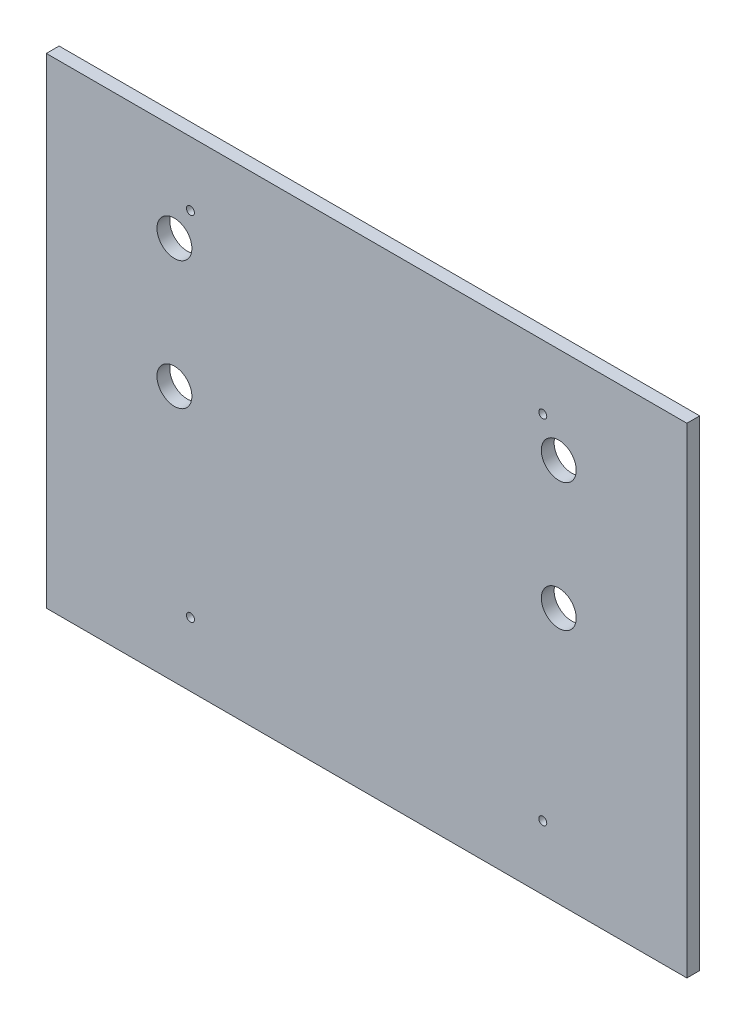
ISO-10303-21;
HEADER;
FILE_DESCRIPTION(('STEP AP214'),'2;1');
FILE_NAME('part.step','',(''),(''),'','','');
FILE_SCHEMA(('AUTOMOTIVE_DESIGN { 1 0 10303 214 1 1 1 1 }'));
ENDSEC;
DATA;
#1=APPLICATION_CONTEXT('core data for automotive mechanical design processes');
#2=APPLICATION_PROTOCOL_DEFINITION('international standard','automotive_design',2000,#1);
#3=PRODUCT_CONTEXT('',#1,'mechanical');
#4=PRODUCT('Part','Part','',(#3));
#5=PRODUCT_RELATED_PRODUCT_CATEGORY('part','',(#4));
#6=PRODUCT_DEFINITION_FORMATION('','',#4);
#7=PRODUCT_DEFINITION_CONTEXT('part definition',#1,'design');
#8=PRODUCT_DEFINITION('design','',#6,#7);
#9=PRODUCT_DEFINITION_SHAPE('','',#8);
#10=(LENGTH_UNIT() NAMED_UNIT(*) SI_UNIT(.MILLI.,.METRE.));
#11=(NAMED_UNIT(*) PLANE_ANGLE_UNIT() SI_UNIT($,.RADIAN.));
#12=(NAMED_UNIT(*) SI_UNIT($,.STERADIAN.) SOLID_ANGLE_UNIT());
#13=UNCERTAINTY_MEASURE_WITH_UNIT(LENGTH_MEASURE(1.E-05),#10,'distance_accuracy_value','');
#14=(GEOMETRIC_REPRESENTATION_CONTEXT(3) GLOBAL_UNCERTAINTY_ASSIGNED_CONTEXT((#13)) GLOBAL_UNIT_ASSIGNED_CONTEXT((#10,
#11,#12)) REPRESENTATION_CONTEXT('',''));
#15=CARTESIAN_POINT('',(0.,0.,0.));
#16=DIRECTION('',(0.,0.,1.));
#17=DIRECTION('',(1.,0.,0.));
#18=AXIS2_PLACEMENT_3D('',#15,#16,#17);
#19=CARTESIAN_POINT('',(0.,0.,8.));
#20=DIRECTION('',(0.,0.,1.));
#21=DIRECTION('',(1.,0.,0.));
#22=AXIS2_PLACEMENT_3D('',#19,#20,#21);
#23=PLANE('',#22);
#24=CARTESIAN_POINT('',(34.3978692290998,-225.797373506058,8.));
#25=DIRECTION('',(0.,0.,1.));
#26=DIRECTION('',(1.,0.,0.));
#27=AXIS2_PLACEMENT_3D('',#24,#25,#26);
#28=CIRCLE('',#27,2.5);
#29=CARTESIAN_POINT('',(36.8978692290998,-225.797373506058,8.));
#30=VERTEX_POINT('',#29);
#31=EDGE_CURVE('E310',#30,#30,#28,.T.);
#32=ORIENTED_EDGE('',*,*,#31,.F.);
#33=EDGE_LOOP('',(#32));
#34=FACE_BOUND('',#33,.T.);
#35=CARTESIAN_POINT('',(254.3978692291,-5.79737350605809,8.));
#36=DIRECTION('',(0.,0.,1.));
#37=DIRECTION('',(1.,0.,0.));
#38=AXIS2_PLACEMENT_3D('',#35,#36,#37);
#39=CIRCLE('',#38,2.50000000000002);
#40=CARTESIAN_POINT('',(256.8978692291,-5.79737350605809,8.));
#41=VERTEX_POINT('',#40);
#42=EDGE_CURVE('E319',#41,#41,#39,.T.);
#43=ORIENTED_EDGE('',*,*,#42,.F.);
#44=EDGE_LOOP('',(#43));
#45=FACE_BOUND('',#44,.T.);
#46=CARTESIAN_POINT('',(264.3978692291,-25.7973735060581,8.));
#47=DIRECTION('',(0.,0.,1.));
#48=DIRECTION('',(-1.,0.,0.));
#49=AXIS2_PLACEMENT_3D('',#46,#47,#48);
#50=CIRCLE('',#49,10.9);
#51=CARTESIAN_POINT('',(253.4978692291,-25.7973735060581,8.));
#52=VERTEX_POINT('',#51);
#53=EDGE_CURVE('E130',#52,#52,#50,.T.);
#54=ORIENTED_EDGE('',*,*,#53,.F.);
#55=EDGE_LOOP('',(#54));
#56=FACE_BOUND('',#55,.T.);
#57=CARTESIAN_POINT('',(24.3978692290998,-105.797373506058,8.));
#58=DIRECTION('',(0.,0.,1.));
#59=DIRECTION('',(1.,0.,0.));
#60=AXIS2_PLACEMENT_3D('',#57,#58,#59);
#61=CIRCLE('',#60,10.9);
#62=CARTESIAN_POINT('',(35.2978692290998,-105.797373506058,8.));
#63=VERTEX_POINT('',#62);
#64=EDGE_CURVE('E131',#63,#63,#61,.T.);
#65=ORIENTED_EDGE('',*,*,#64,.F.);
#66=EDGE_LOOP('',(#65));
#67=FACE_BOUND('',#66,.T.);
#68=DIRECTION('',(0.,-1.,0.));
#69=VECTOR('',#68,1.);
#70=CARTESIAN_POINT('',(-55.6021307709002,34.2026264939419,8.));
#71=LINE('',#70,#69);
#72=CARTESIAN_POINT('',(-55.6021307709002,34.2026264939419,8.));
#73=VERTEX_POINT('',#72);
#74=CARTESIAN_POINT('',(-55.6021307709002,-265.797373506058,8.));
#75=VERTEX_POINT('',#74);
#76=EDGE_CURVE('E92',#73,#75,#71,.T.);
#77=ORIENTED_EDGE('',*,*,#76,.T.);
#78=DIRECTION('',(1.,0.,0.));
#79=VECTOR('',#78,1.);
#80=CARTESIAN_POINT('',(-55.6021307709002,-265.797373506058,8.));
#81=LINE('',#80,#79);
#82=CARTESIAN_POINT('',(344.3978692291,-265.797373506058,8.));
#83=VERTEX_POINT('',#82);
#84=EDGE_CURVE('E87',#75,#83,#81,.T.);
#85=ORIENTED_EDGE('',*,*,#84,.T.);
#86=DIRECTION('',(0.,1.,0.));
#87=VECTOR('',#86,1.);
#88=CARTESIAN_POINT('',(344.3978692291,-265.797373506058,8.));
#89=LINE('',#88,#87);
#90=CARTESIAN_POINT('',(344.3978692291,34.2026264939419,8.));
#91=VERTEX_POINT('',#90);
#92=EDGE_CURVE('E90',#83,#91,#89,.T.);
#93=ORIENTED_EDGE('',*,*,#92,.T.);
#94=DIRECTION('',(-1.,0.,0.));
#95=VECTOR('',#94,1.);
#96=CARTESIAN_POINT('',(-55.6021307709002,34.2026264939419,8.));
#97=LINE('',#96,#95);
#98=EDGE_CURVE('E57',#91,#73,#97,.T.);
#99=ORIENTED_EDGE('',*,*,#98,.T.);
#100=EDGE_LOOP('',(#77,#85,#93,#99));
#101=FACE_BOUND('',#100,.T.);
#102=CARTESIAN_POINT('',(24.3978692290998,-25.7973735060581,8.));
#103=DIRECTION('',(0.,0.,1.));
#104=DIRECTION('',(1.,0.,0.));
#105=AXIS2_PLACEMENT_3D('',#102,#103,#104);
#106=CIRCLE('',#105,10.9);
#107=CARTESIAN_POINT('',(35.2978692290998,-25.7973735060581,8.));
#108=VERTEX_POINT('',#107);
#109=EDGE_CURVE('E118',#108,#108,#106,.T.);
#110=ORIENTED_EDGE('',*,*,#109,.F.);
#111=EDGE_LOOP('',(#110));
#112=FACE_BOUND('',#111,.T.);
#113=CARTESIAN_POINT('',(264.3978692291,-105.797373506058,8.));
#114=DIRECTION('',(0.,0.,1.));
#115=DIRECTION('',(1.,0.,0.));
#116=AXIS2_PLACEMENT_3D('',#113,#114,#115);
#117=CIRCLE('',#116,10.9);
#118=CARTESIAN_POINT('',(275.2978692291,-105.797373506058,8.));
#119=VERTEX_POINT('',#118);
#120=EDGE_CURVE('E329',#119,#119,#117,.T.);
#121=ORIENTED_EDGE('',*,*,#120,.F.);
#122=EDGE_LOOP('',(#121));
#123=FACE_BOUND('',#122,.T.);
#124=CARTESIAN_POINT('',(34.3978692290998,-5.79737350605809,8.));
#125=DIRECTION('',(0.,0.,1.));
#126=DIRECTION('',(-1.,0.,0.));
#127=AXIS2_PLACEMENT_3D('',#124,#125,#126);
#128=CIRCLE('',#127,2.50000000000002);
#129=CARTESIAN_POINT('',(31.8978692290998,-5.79737350605809,8.));
#130=VERTEX_POINT('',#129);
#131=EDGE_CURVE('E328',#130,#130,#128,.T.);
#132=ORIENTED_EDGE('',*,*,#131,.F.);
#133=EDGE_LOOP('',(#132));
#134=FACE_BOUND('',#133,.T.);
#135=CARTESIAN_POINT('',(254.3978692291,-225.797373506058,8.));
#136=DIRECTION('',(0.,0.,1.));
#137=DIRECTION('',(-1.,0.,0.));
#138=AXIS2_PLACEMENT_3D('',#135,#136,#137);
#139=CIRCLE('',#138,2.49999999999997);
#140=CARTESIAN_POINT('',(251.8978692291,-225.797373506058,8.));
#141=VERTEX_POINT('',#140);
#142=EDGE_CURVE('E300',#141,#141,#139,.T.);
#143=ORIENTED_EDGE('',*,*,#142,.F.);
#144=EDGE_LOOP('',(#143));
#145=FACE_BOUND('',#144,.T.);
#146=ADVANCED_FACE('F40',(#34,#45,#56,#67,#101,#112,#123,#134,#145),#23,.T.);
#147=CARTESIAN_POINT('',(0.,0.,0.));
#148=DIRECTION('',(0.,0.,1.));
#149=DIRECTION('',(1.,0.,0.));
#150=AXIS2_PLACEMENT_3D('',#147,#148,#149);
#151=PLANE('',#150);
#152=DIRECTION('',(0.,-1.,0.));
#153=VECTOR('',#152,1.);
#154=CARTESIAN_POINT('',(-55.6021307709002,34.2026264939419,0.));
#155=LINE('',#154,#153);
#156=CARTESIAN_POINT('',(-55.6021307709002,34.2026264939419,0.));
#157=VERTEX_POINT('',#156);
#158=CARTESIAN_POINT('',(-55.6021307709002,-265.797373506058,0.));
#159=VERTEX_POINT('',#158);
#160=EDGE_CURVE('E136',#157,#159,#155,.T.);
#161=ORIENTED_EDGE('',*,*,#160,.F.);
#162=DIRECTION('',(-1.,0.,0.));
#163=VECTOR('',#162,1.);
#164=CARTESIAN_POINT('',(-55.6021307709002,34.2026264939419,0.));
#165=LINE('',#164,#163);
#166=CARTESIAN_POINT('',(344.3978692291,34.2026264939419,0.));
#167=VERTEX_POINT('',#166);
#168=EDGE_CURVE('E80',#167,#157,#165,.T.);
#169=ORIENTED_EDGE('',*,*,#168,.F.);
#170=DIRECTION('',(0.,1.,0.));
#171=VECTOR('',#170,1.);
#172=CARTESIAN_POINT('',(344.3978692291,-265.797373506058,0.));
#173=LINE('',#172,#171);
#174=CARTESIAN_POINT('',(344.3978692291,-265.797373506058,0.));
#175=VERTEX_POINT('',#174);
#176=EDGE_CURVE('E74',#175,#167,#173,.T.);
#177=ORIENTED_EDGE('',*,*,#176,.F.);
#178=DIRECTION('',(1.,0.,0.));
#179=VECTOR('',#178,1.);
#180=CARTESIAN_POINT('',(-55.6021307709002,-265.797373506058,0.));
#181=LINE('',#180,#179);
#182=EDGE_CURVE('E97',#159,#175,#181,.T.);
#183=ORIENTED_EDGE('',*,*,#182,.F.);
#184=EDGE_LOOP('',(#161,#169,#177,#183));
#185=FACE_BOUND('',#184,.T.);
#186=CARTESIAN_POINT('',(24.3978692290998,-105.797373506058,0.));
#187=DIRECTION('',(0.,0.,1.));
#188=DIRECTION('',(1.,0.,0.));
#189=AXIS2_PLACEMENT_3D('',#186,#187,#188);
#190=CIRCLE('',#189,10.9);
#191=CARTESIAN_POINT('',(35.2978692290998,-105.797373506058,0.));
#192=VERTEX_POINT('',#191);
#193=EDGE_CURVE('E124',#192,#192,#190,.T.);
#194=ORIENTED_EDGE('',*,*,#193,.T.);
#195=EDGE_LOOP('',(#194));
#196=FACE_BOUND('',#195,.T.);
#197=CARTESIAN_POINT('',(24.3978692290998,-25.7973735060581,0.));
#198=DIRECTION('',(0.,0.,1.));
#199=DIRECTION('',(1.,0.,0.));
#200=AXIS2_PLACEMENT_3D('',#197,#198,#199);
#201=CIRCLE('',#200,10.9);
#202=CARTESIAN_POINT('',(35.2978692290998,-25.7973735060581,0.));
#203=VERTEX_POINT('',#202);
#204=EDGE_CURVE('E125',#203,#203,#201,.T.);
#205=ORIENTED_EDGE('',*,*,#204,.T.);
#206=EDGE_LOOP('',(#205));
#207=FACE_BOUND('',#206,.T.);
#208=CARTESIAN_POINT('',(264.3978692291,-25.7973735060581,0.));
#209=DIRECTION('',(0.,0.,1.));
#210=DIRECTION('',(-1.,0.,0.));
#211=AXIS2_PLACEMENT_3D('',#208,#209,#210);
#212=CIRCLE('',#211,10.9);
#213=CARTESIAN_POINT('',(253.4978692291,-25.7973735060581,0.));
#214=VERTEX_POINT('',#213);
#215=EDGE_CURVE('E126',#214,#214,#212,.T.);
#216=ORIENTED_EDGE('',*,*,#215,.T.);
#217=EDGE_LOOP('',(#216));
#218=FACE_BOUND('',#217,.T.);
#219=CARTESIAN_POINT('',(264.3978692291,-105.797373506058,0.));
#220=DIRECTION('',(0.,0.,1.));
#221=DIRECTION('',(1.,0.,0.));
#222=AXIS2_PLACEMENT_3D('',#219,#220,#221);
#223=CIRCLE('',#222,10.9);
#224=CARTESIAN_POINT('',(275.2978692291,-105.797373506058,0.));
#225=VERTEX_POINT('',#224);
#226=EDGE_CURVE('E325',#225,#225,#223,.T.);
#227=ORIENTED_EDGE('',*,*,#226,.T.);
#228=EDGE_LOOP('',(#227));
#229=FACE_BOUND('',#228,.T.);
#230=CARTESIAN_POINT('',(254.3978692291,-5.79737350605809,0.));
#231=DIRECTION('',(0.,0.,1.));
#232=DIRECTION('',(1.,0.,0.));
#233=AXIS2_PLACEMENT_3D('',#230,#231,#232);
#234=CIRCLE('',#233,2.50000000000002);
#235=CARTESIAN_POINT('',(256.8978692291,-5.79737350605809,0.));
#236=VERTEX_POINT('',#235);
#237=EDGE_CURVE('E326',#236,#236,#234,.T.);
#238=ORIENTED_EDGE('',*,*,#237,.T.);
#239=EDGE_LOOP('',(#238));
#240=FACE_BOUND('',#239,.T.);
#241=CARTESIAN_POINT('',(34.3978692290998,-5.79737350605809,0.));
#242=DIRECTION('',(0.,0.,1.));
#243=DIRECTION('',(-1.,0.,0.));
#244=AXIS2_PLACEMENT_3D('',#241,#242,#243);
#245=CIRCLE('',#244,2.50000000000002);
#246=CARTESIAN_POINT('',(31.8978692290998,-5.79737350605809,0.));
#247=VERTEX_POINT('',#246);
#248=EDGE_CURVE('E315',#247,#247,#245,.T.);
#249=ORIENTED_EDGE('',*,*,#248,.T.);
#250=EDGE_LOOP('',(#249));
#251=FACE_BOUND('',#250,.T.);
#252=CARTESIAN_POINT('',(34.3978692290998,-225.797373506058,0.));
#253=DIRECTION('',(0.,0.,1.));
#254=DIRECTION('',(1.,0.,0.));
#255=AXIS2_PLACEMENT_3D('',#252,#253,#254);
#256=CIRCLE('',#255,2.5);
#257=CARTESIAN_POINT('',(36.8978692290998,-225.797373506058,0.));
#258=VERTEX_POINT('',#257);
#259=EDGE_CURVE('E307',#258,#258,#256,.T.);
#260=ORIENTED_EDGE('',*,*,#259,.T.);
#261=EDGE_LOOP('',(#260));
#262=FACE_BOUND('',#261,.T.);
#263=CARTESIAN_POINT('',(254.3978692291,-225.797373506058,0.));
#264=DIRECTION('',(0.,0.,1.));
#265=DIRECTION('',(-1.,0.,0.));
#266=AXIS2_PLACEMENT_3D('',#263,#264,#265);
#267=CIRCLE('',#266,2.49999999999997);
#268=CARTESIAN_POINT('',(251.8978692291,-225.797373506058,0.));
#269=VERTEX_POINT('',#268);
#270=EDGE_CURVE('E303',#269,#269,#267,.T.);
#271=ORIENTED_EDGE('',*,*,#270,.T.);
#272=EDGE_LOOP('',(#271));
#273=FACE_BOUND('',#272,.T.);
#274=ADVANCED_FACE('F150',(#185,#196,#207,#218,#229,#240,#251,#262,#273),#151,.F.);
#275=CARTESIAN_POINT('',(-55.6021307709002,34.2026264939419,8.));
#276=DIRECTION('',(1.,0.,0.));
#277=DIRECTION('',(0.,1.,0.));
#278=AXIS2_PLACEMENT_3D('',#275,#276,#277);
#279=PLANE('',#278);
#280=ORIENTED_EDGE('',*,*,#160,.T.);
#281=DIRECTION('',(0.,0.,-1.));
#282=VECTOR('',#281,1.);
#283=CARTESIAN_POINT('',(-55.6021307709002,-265.797373506058,8.));
#284=LINE('',#283,#282);
#285=EDGE_CURVE('E12',#75,#159,#284,.T.);
#286=ORIENTED_EDGE('',*,*,#285,.F.);
#287=ORIENTED_EDGE('',*,*,#76,.F.);
#288=DIRECTION('',(0.,0.,-1.));
#289=VECTOR('',#288,1.);
#290=CARTESIAN_POINT('',(-55.6021307709002,34.2026264939419,8.));
#291=LINE('',#290,#289);
#292=EDGE_CURVE('E103',#73,#157,#291,.T.);
#293=ORIENTED_EDGE('',*,*,#292,.T.);
#294=EDGE_LOOP('',(#280,#286,#287,#293));
#295=FACE_BOUND('',#294,.T.);
#296=ADVANCED_FACE('F42',(#295),#279,.F.);
#297=CARTESIAN_POINT('',(-55.6021307709002,-265.797373506058,8.));
#298=DIRECTION('',(0.,1.,0.));
#299=DIRECTION('',(0.,0.,1.));
#300=AXIS2_PLACEMENT_3D('',#297,#298,#299);
#301=PLANE('',#300);
#302=ORIENTED_EDGE('',*,*,#182,.T.);
#303=DIRECTION('',(0.,0.,-1.));
#304=VECTOR('',#303,1.);
#305=CARTESIAN_POINT('',(344.3978692291,-265.797373506058,8.));
#306=LINE('',#305,#304);
#307=EDGE_CURVE('E49',#83,#175,#306,.T.);
#308=ORIENTED_EDGE('',*,*,#307,.F.);
#309=ORIENTED_EDGE('',*,*,#84,.F.);
#310=ORIENTED_EDGE('',*,*,#285,.T.);
#311=EDGE_LOOP('',(#302,#308,#309,#310));
#312=FACE_BOUND('',#311,.T.);
#313=ADVANCED_FACE('F96',(#312),#301,.F.);
#314=CARTESIAN_POINT('',(344.3978692291,-265.797373506058,8.));
#315=DIRECTION('',(-1.,0.,0.));
#316=DIRECTION('',(0.,0.,1.));
#317=AXIS2_PLACEMENT_3D('',#314,#315,#316);
#318=PLANE('',#317);
#319=ORIENTED_EDGE('',*,*,#176,.T.);
#320=DIRECTION('',(0.,0.,-1.));
#321=VECTOR('',#320,1.);
#322=CARTESIAN_POINT('',(344.3978692291,34.2026264939419,8.));
#323=LINE('',#322,#321);
#324=EDGE_CURVE('E98',#91,#167,#323,.T.);
#325=ORIENTED_EDGE('',*,*,#324,.F.);
#326=ORIENTED_EDGE('',*,*,#92,.F.);
#327=ORIENTED_EDGE('',*,*,#307,.T.);
#328=EDGE_LOOP('',(#319,#325,#326,#327));
#329=FACE_BOUND('',#328,.T.);
#330=ADVANCED_FACE('F99',(#329),#318,.F.);
#331=CARTESIAN_POINT('',(-55.6021307709002,34.2026264939419,8.));
#332=DIRECTION('',(0.,-1.,0.));
#333=DIRECTION('',(0.,0.,-1.));
#334=AXIS2_PLACEMENT_3D('',#331,#332,#333);
#335=PLANE('',#334);
#336=ORIENTED_EDGE('',*,*,#168,.T.);
#337=ORIENTED_EDGE('',*,*,#292,.F.);
#338=ORIENTED_EDGE('',*,*,#98,.F.);
#339=ORIENTED_EDGE('',*,*,#324,.T.);
#340=EDGE_LOOP('',(#336,#337,#338,#339));
#341=FACE_BOUND('',#340,.T.);
#342=ADVANCED_FACE('F147',(#341),#335,.F.);
#343=CARTESIAN_POINT('',(24.3978692290998,-105.797373506058,8.));
#344=DIRECTION('',(0.,0.,-1.));
#345=DIRECTION('',(-1.,0.,0.));
#346=AXIS2_PLACEMENT_3D('',#343,#344,#345);
#347=CYLINDRICAL_SURFACE('',#346,10.9);
#348=ORIENTED_EDGE('',*,*,#64,.T.);
#349=EDGE_LOOP('',(#348));
#350=FACE_BOUND('',#349,.T.);
#351=ORIENTED_EDGE('',*,*,#193,.F.);
#352=EDGE_LOOP('',(#351));
#353=FACE_BOUND('',#352,.T.);
#354=ADVANCED_FACE('F168',(#350,#353),#347,.F.);
#355=CARTESIAN_POINT('',(24.3978692290998,-25.7973735060581,8.));
#356=DIRECTION('',(0.,0.,-1.));
#357=DIRECTION('',(-1.,0.,0.));
#358=AXIS2_PLACEMENT_3D('',#355,#356,#357);
#359=CYLINDRICAL_SURFACE('',#358,10.9);
#360=ORIENTED_EDGE('',*,*,#109,.T.);
#361=EDGE_LOOP('',(#360));
#362=FACE_BOUND('',#361,.T.);
#363=ORIENTED_EDGE('',*,*,#204,.F.);
#364=EDGE_LOOP('',(#363));
#365=FACE_BOUND('',#364,.T.);
#366=ADVANCED_FACE('F186',(#362,#365),#359,.F.);
#367=CARTESIAN_POINT('',(264.3978692291,-25.7973735060581,8.));
#368=DIRECTION('',(0.,0.,-1.));
#369=DIRECTION('',(-1.,0.,0.));
#370=AXIS2_PLACEMENT_3D('',#367,#368,#369);
#371=CYLINDRICAL_SURFACE('',#370,10.9);
#372=ORIENTED_EDGE('',*,*,#53,.T.);
#373=EDGE_LOOP('',(#372));
#374=FACE_BOUND('',#373,.T.);
#375=ORIENTED_EDGE('',*,*,#215,.F.);
#376=EDGE_LOOP('',(#375));
#377=FACE_BOUND('',#376,.T.);
#378=ADVANCED_FACE('F192',(#374,#377),#371,.F.);
#379=CARTESIAN_POINT('',(264.3978692291,-105.797373506058,8.));
#380=DIRECTION('',(0.,0.,-1.));
#381=DIRECTION('',(-1.,0.,0.));
#382=AXIS2_PLACEMENT_3D('',#379,#380,#381);
#383=CYLINDRICAL_SURFACE('',#382,10.9);
#384=ORIENTED_EDGE('',*,*,#120,.T.);
#385=EDGE_LOOP('',(#384));
#386=FACE_BOUND('',#385,.T.);
#387=ORIENTED_EDGE('',*,*,#226,.F.);
#388=EDGE_LOOP('',(#387));
#389=FACE_BOUND('',#388,.T.);
#390=ADVANCED_FACE('F198',(#386,#389),#383,.F.);
#391=CARTESIAN_POINT('',(254.3978692291,-5.79737350605809,8.));
#392=DIRECTION('',(0.,0.,-1.));
#393=DIRECTION('',(-1.,0.,0.));
#394=AXIS2_PLACEMENT_3D('',#391,#392,#393);
#395=CYLINDRICAL_SURFACE('',#394,2.50000000000002);
#396=ORIENTED_EDGE('',*,*,#42,.T.);
#397=EDGE_LOOP('',(#396));
#398=FACE_BOUND('',#397,.T.);
#399=ORIENTED_EDGE('',*,*,#237,.F.);
#400=EDGE_LOOP('',(#399));
#401=FACE_BOUND('',#400,.T.);
#402=ADVANCED_FACE('F205',(#398,#401),#395,.F.);
#403=CARTESIAN_POINT('',(34.3978692290998,-5.79737350605809,8.));
#404=DIRECTION('',(0.,0.,-1.));
#405=DIRECTION('',(-1.,0.,0.));
#406=AXIS2_PLACEMENT_3D('',#403,#404,#405);
#407=CYLINDRICAL_SURFACE('',#406,2.50000000000002);
#408=ORIENTED_EDGE('',*,*,#131,.T.);
#409=EDGE_LOOP('',(#408));
#410=FACE_BOUND('',#409,.T.);
#411=ORIENTED_EDGE('',*,*,#248,.F.);
#412=EDGE_LOOP('',(#411));
#413=FACE_BOUND('',#412,.T.);
#414=ADVANCED_FACE('F212',(#410,#413),#407,.F.);
#415=CARTESIAN_POINT('',(34.3978692290998,-225.797373506058,8.));
#416=DIRECTION('',(0.,0.,-1.));
#417=DIRECTION('',(-1.,0.,0.));
#418=AXIS2_PLACEMENT_3D('',#415,#416,#417);
#419=CYLINDRICAL_SURFACE('',#418,2.5);
#420=ORIENTED_EDGE('',*,*,#31,.T.);
#421=EDGE_LOOP('',(#420));
#422=FACE_BOUND('',#421,.T.);
#423=ORIENTED_EDGE('',*,*,#259,.F.);
#424=EDGE_LOOP('',(#423));
#425=FACE_BOUND('',#424,.T.);
#426=ADVANCED_FACE('F219',(#422,#425),#419,.F.);
#427=CARTESIAN_POINT('',(254.3978692291,-225.797373506058,8.));
#428=DIRECTION('',(0.,0.,-1.));
#429=DIRECTION('',(-1.,0.,0.));
#430=AXIS2_PLACEMENT_3D('',#427,#428,#429);
#431=CYLINDRICAL_SURFACE('',#430,2.49999999999997);
#432=ORIENTED_EDGE('',*,*,#142,.T.);
#433=EDGE_LOOP('',(#432));
#434=FACE_BOUND('',#433,.T.);
#435=ORIENTED_EDGE('',*,*,#270,.F.);
#436=EDGE_LOOP('',(#435));
#437=FACE_BOUND('',#436,.T.);
#438=ADVANCED_FACE('F226',(#434,#437),#431,.F.);
#439=CLOSED_SHELL('',(#146,#274,#296,#313,#330,#342,#354,#366,#378,#390,#402,#414,#426,#438));
#440=MANIFOLD_SOLID_BREP('B2',#439);
#441=ADVANCED_BREP_SHAPE_REPRESENTATION('',(#18,#440),#14);
#442=SHAPE_DEFINITION_REPRESENTATION(#9,#441);
ENDSEC;
END-ISO-10303-21;
